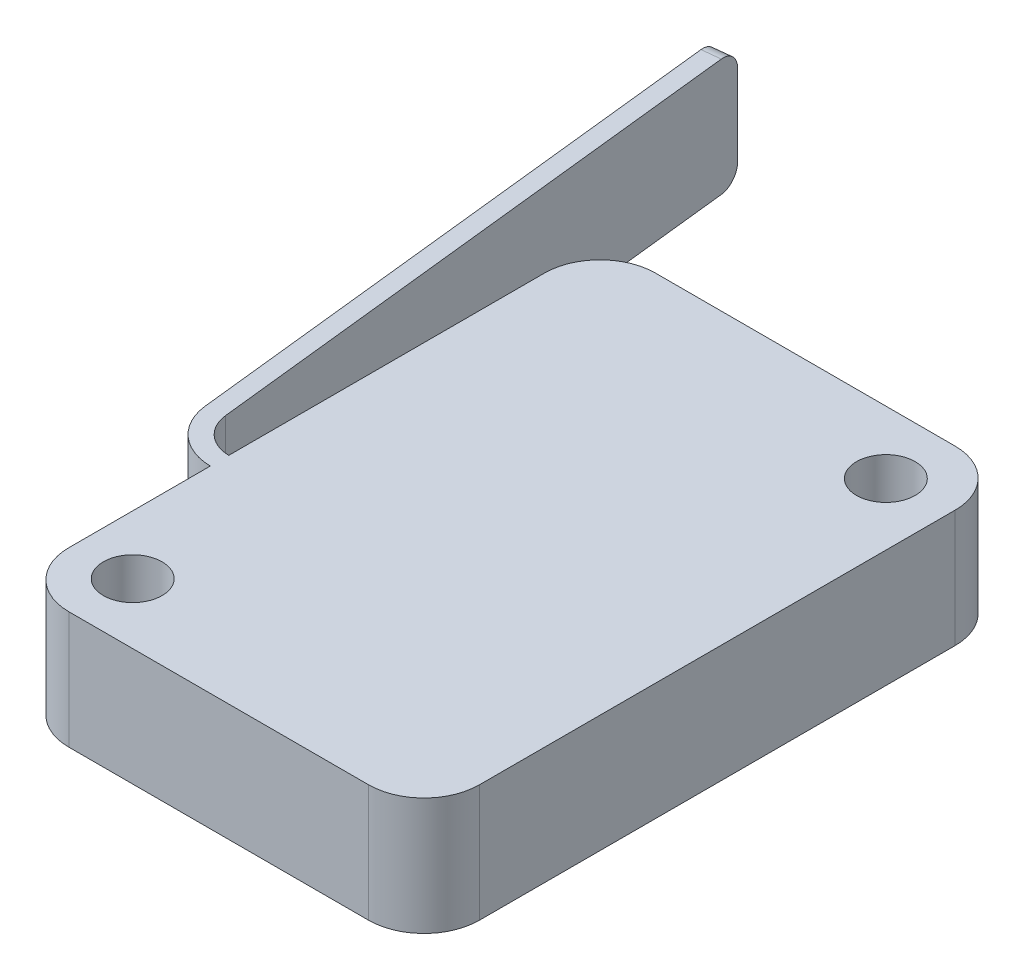
ISO-10303-21;
HEADER;
FILE_DESCRIPTION(('STEP AP214'),'2;1');
FILE_NAME('part.step','',(''),(''),'','','');
FILE_SCHEMA(('AUTOMOTIVE_DESIGN { 1 0 10303 214 1 1 1 1 }'));
ENDSEC;
DATA;
#1=APPLICATION_CONTEXT('core data for automotive mechanical design processes');
#2=APPLICATION_PROTOCOL_DEFINITION('international standard','automotive_design',2000,#1);
#3=PRODUCT_CONTEXT('',#1,'mechanical');
#4=PRODUCT('Part','Part','',(#3));
#5=PRODUCT_RELATED_PRODUCT_CATEGORY('part','',(#4));
#6=PRODUCT_DEFINITION_FORMATION('','',#4);
#7=PRODUCT_DEFINITION_CONTEXT('part definition',#1,'design');
#8=PRODUCT_DEFINITION('design','',#6,#7);
#9=PRODUCT_DEFINITION_SHAPE('','',#8);
#10=(LENGTH_UNIT() NAMED_UNIT(*) SI_UNIT(.MILLI.,.METRE.));
#11=(NAMED_UNIT(*) PLANE_ANGLE_UNIT() SI_UNIT($,.RADIAN.));
#12=(NAMED_UNIT(*) SI_UNIT($,.STERADIAN.) SOLID_ANGLE_UNIT());
#13=UNCERTAINTY_MEASURE_WITH_UNIT(LENGTH_MEASURE(1.E-05),#10,'distance_accuracy_value','');
#14=(GEOMETRIC_REPRESENTATION_CONTEXT(3) GLOBAL_UNCERTAINTY_ASSIGNED_CONTEXT((#13)) GLOBAL_UNIT_ASSIGNED_CONTEXT((#10,
#11,#12)) REPRESENTATION_CONTEXT('',''));
#15=CARTESIAN_POINT('',(0.,0.,0.));
#16=DIRECTION('',(0.,0.,1.));
#17=DIRECTION('',(1.,0.,0.));
#18=AXIS2_PLACEMENT_3D('',#15,#16,#17);
#19=CARTESIAN_POINT('',(-11.1125,6.35,15.875));
#20=DIRECTION('',(1.,0.,0.));
#21=DIRECTION('',(0.,0.,-1.));
#22=AXIS2_PLACEMENT_3D('',#19,#20,#21);
#23=PLANE('',#22);
#24=DIRECTION('',(0.,0.,1.));
#25=VECTOR('',#24,1.);
#26=CARTESIAN_POINT('',(-11.1125,0.,15.875));
#27=LINE('',#26,#25);
#28=CARTESIAN_POINT('',(-11.1125,0.,-12.875));
#29=VERTEX_POINT('',#28);
#30=CARTESIAN_POINT('',(-11.1125,0.,4.21666692304194));
#31=VERTEX_POINT('',#30);
#32=EDGE_CURVE('E221',#29,#31,#27,.T.);
#33=ORIENTED_EDGE('',*,*,#32,.T.);
#34=DIRECTION('',(0.,1.,0.));
#35=VECTOR('',#34,1.);
#36=CARTESIAN_POINT('',(-11.1125,0.,4.21666692304194));
#37=LINE('',#36,#35);
#38=CARTESIAN_POINT('',(-11.1125,6.35,4.21666692304194));
#39=VERTEX_POINT('',#38);
#40=EDGE_CURVE('E197',#31,#39,#37,.T.);
#41=ORIENTED_EDGE('',*,*,#40,.T.);
#42=DIRECTION('',(0.,0.,1.));
#43=VECTOR('',#42,1.);
#44=CARTESIAN_POINT('',(-11.1125,6.35,15.875));
#45=LINE('',#44,#43);
#46=CARTESIAN_POINT('',(-11.1125,6.35,-12.875));
#47=VERTEX_POINT('',#46);
#48=EDGE_CURVE('E209',#47,#39,#45,.T.);
#49=ORIENTED_EDGE('',*,*,#48,.F.);
#50=DIRECTION('',(0.,-1.,0.));
#51=VECTOR('',#50,1.);
#52=CARTESIAN_POINT('',(-11.1125,6.35,-12.875));
#53=LINE('',#52,#51);
#54=EDGE_CURVE('E254',#47,#29,#53,.T.);
#55=ORIENTED_EDGE('',*,*,#54,.T.);
#56=EDGE_LOOP('',(#33,#41,#49,#55));
#57=FACE_BOUND('',#56,.T.);
#58=ADVANCED_FACE('F33',(#57),#23,.F.);
#59=CARTESIAN_POINT('',(11.1125,6.35,15.875));
#60=DIRECTION('',(-1.,0.,0.));
#61=DIRECTION('',(0.,0.,1.));
#62=AXIS2_PLACEMENT_3D('',#59,#60,#61);
#63=PLANE('',#62);
#64=DIRECTION('',(0.,0.,-1.));
#65=VECTOR('',#64,1.);
#66=CARTESIAN_POINT('',(11.1125,0.,15.875));
#67=LINE('',#66,#65);
#68=CARTESIAN_POINT('',(11.1125,0.,12.875));
#69=VERTEX_POINT('',#68);
#70=CARTESIAN_POINT('',(11.1125,0.,-12.875));
#71=VERTEX_POINT('',#70);
#72=EDGE_CURVE('E200',#69,#71,#67,.T.);
#73=ORIENTED_EDGE('',*,*,#72,.T.);
#74=DIRECTION('',(0.,-1.,0.));
#75=VECTOR('',#74,1.);
#76=CARTESIAN_POINT('',(11.1125,6.35,-12.875));
#77=LINE('',#76,#75);
#78=CARTESIAN_POINT('',(11.1125,6.35,-12.875));
#79=VERTEX_POINT('',#78);
#80=EDGE_CURVE('E241',#71,#79,#77,.F.);
#81=ORIENTED_EDGE('',*,*,#80,.T.);
#82=DIRECTION('',(0.,0.,-1.));
#83=VECTOR('',#82,1.);
#84=CARTESIAN_POINT('',(11.1125,6.35,15.875));
#85=LINE('',#84,#83);
#86=CARTESIAN_POINT('',(11.1125,6.35,12.875));
#87=VERTEX_POINT('',#86);
#88=EDGE_CURVE('E201',#87,#79,#85,.T.);
#89=ORIENTED_EDGE('',*,*,#88,.F.);
#90=DIRECTION('',(0.,-1.,0.));
#91=VECTOR('',#90,1.);
#92=CARTESIAN_POINT('',(11.1125,6.35,12.875));
#93=LINE('',#92,#91);
#94=EDGE_CURVE('E238',#87,#69,#93,.T.);
#95=ORIENTED_EDGE('',*,*,#94,.T.);
#96=EDGE_LOOP('',(#73,#81,#89,#95));
#97=FACE_BOUND('',#96,.T.);
#98=ADVANCED_FACE('F326',(#97),#63,.F.);
#99=CARTESIAN_POINT('',(-11.1125,6.35,-15.875));
#100=DIRECTION('',(0.,0.,1.));
#101=DIRECTION('',(1.,0.,0.));
#102=AXIS2_PLACEMENT_3D('',#99,#100,#101);
#103=PLANE('',#102);
#104=DIRECTION('',(-1.,0.,0.));
#105=VECTOR('',#104,1.);
#106=CARTESIAN_POINT('',(-11.1125,6.35,-15.875));
#107=LINE('',#106,#105);
#108=CARTESIAN_POINT('',(8.11250000000001,6.35,-15.875));
#109=VERTEX_POINT('',#108);
#110=CARTESIAN_POINT('',(-8.11249999999999,6.35,-15.875));
#111=VERTEX_POINT('',#110);
#112=EDGE_CURVE('E204',#109,#111,#107,.T.);
#113=ORIENTED_EDGE('',*,*,#112,.F.);
#114=DIRECTION('',(0.,-1.,0.));
#115=VECTOR('',#114,1.);
#116=CARTESIAN_POINT('',(8.11250000000001,6.35,-15.875));
#117=LINE('',#116,#115);
#118=CARTESIAN_POINT('',(8.11250000000001,0.,-15.875));
#119=VERTEX_POINT('',#118);
#120=EDGE_CURVE('E227',#109,#119,#117,.T.);
#121=ORIENTED_EDGE('',*,*,#120,.T.);
#122=DIRECTION('',(-1.,0.,0.));
#123=VECTOR('',#122,1.);
#124=CARTESIAN_POINT('',(-11.1125,0.,-15.875));
#125=LINE('',#124,#123);
#126=CARTESIAN_POINT('',(-8.11249999999999,0.,-15.875));
#127=VERTEX_POINT('',#126);
#128=EDGE_CURVE('E218',#119,#127,#125,.T.);
#129=ORIENTED_EDGE('',*,*,#128,.T.);
#130=DIRECTION('',(0.,-1.,0.));
#131=VECTOR('',#130,1.);
#132=CARTESIAN_POINT('',(-8.11249999999999,6.35,-15.875));
#133=LINE('',#132,#131);
#134=EDGE_CURVE('E215',#127,#111,#133,.F.);
#135=ORIENTED_EDGE('',*,*,#134,.T.);
#136=EDGE_LOOP('',(#113,#121,#129,#135));
#137=FACE_BOUND('',#136,.T.);
#138=ADVANCED_FACE('F318',(#137),#103,.F.);
#139=CARTESIAN_POINT('',(-11.1125,6.35,5.21677658865884));
#140=VERTEX_POINT('',#139);
#141=CARTESIAN_POINT('',(-11.1125,6.35,12.875));
#142=VERTEX_POINT('',#141);
#143=EDGE_CURVE('E208',#140,#142,#45,.T.);
#144=ORIENTED_EDGE('',*,*,#143,.F.);
#145=DIRECTION('',(0.,1.,0.));
#146=VECTOR('',#145,1.);
#147=CARTESIAN_POINT('',(-11.1125,0.,5.21677658865884));
#148=LINE('',#147,#146);
#149=CARTESIAN_POINT('',(-11.1125,0.,5.21677658865884));
#150=VERTEX_POINT('',#149);
#151=EDGE_CURVE('E191',#140,#150,#148,.F.);
#152=ORIENTED_EDGE('',*,*,#151,.T.);
#153=CARTESIAN_POINT('',(-11.1125,0.,12.875));
#154=VERTEX_POINT('',#153);
#155=EDGE_CURVE('E174',#150,#154,#27,.T.);
#156=ORIENTED_EDGE('',*,*,#155,.T.);
#157=DIRECTION('',(0.,-1.,0.));
#158=VECTOR('',#157,1.);
#159=CARTESIAN_POINT('',(-11.1125,6.35,12.875));
#160=LINE('',#159,#158);
#161=EDGE_CURVE('E251',#154,#142,#160,.F.);
#162=ORIENTED_EDGE('',*,*,#161,.T.);
#163=EDGE_LOOP('',(#144,#152,#156,#162));
#164=FACE_BOUND('',#163,.T.);
#165=ADVANCED_FACE('F343',(#164),#23,.F.);
#166=CARTESIAN_POINT('',(-11.1125,6.35,15.875));
#167=DIRECTION('',(0.,0.,-1.));
#168=DIRECTION('',(-1.,0.,0.));
#169=AXIS2_PLACEMENT_3D('',#166,#167,#168);
#170=PLANE('',#169);
#171=DIRECTION('',(1.,0.,0.));
#172=VECTOR('',#171,1.);
#173=CARTESIAN_POINT('',(-11.1125,0.,15.875));
#174=LINE('',#173,#172);
#175=CARTESIAN_POINT('',(-8.11249999999999,0.,15.875));
#176=VERTEX_POINT('',#175);
#177=CARTESIAN_POINT('',(8.11250000000001,0.,15.875));
#178=VERTEX_POINT('',#177);
#179=EDGE_CURVE('E205',#176,#178,#174,.T.);
#180=ORIENTED_EDGE('',*,*,#179,.T.);
#181=DIRECTION('',(0.,-1.,0.));
#182=VECTOR('',#181,1.);
#183=CARTESIAN_POINT('',(8.11250000000001,6.35,15.875));
#184=LINE('',#183,#182);
#185=CARTESIAN_POINT('',(8.11250000000001,6.35,15.875));
#186=VERTEX_POINT('',#185);
#187=EDGE_CURVE('E260',#178,#186,#184,.F.);
#188=ORIENTED_EDGE('',*,*,#187,.T.);
#189=DIRECTION('',(1.,0.,0.));
#190=VECTOR('',#189,1.);
#191=CARTESIAN_POINT('',(-11.1125,6.35,15.875));
#192=LINE('',#191,#190);
#193=CARTESIAN_POINT('',(-8.11249999999999,6.35,15.875));
#194=VERTEX_POINT('',#193);
#195=EDGE_CURVE('E212',#194,#186,#192,.T.);
#196=ORIENTED_EDGE('',*,*,#195,.F.);
#197=DIRECTION('',(0.,-1.,0.));
#198=VECTOR('',#197,1.);
#199=CARTESIAN_POINT('',(-8.11249999999999,6.35,15.875));
#200=LINE('',#199,#198);
#201=EDGE_CURVE('E257',#194,#176,#200,.T.);
#202=ORIENTED_EDGE('',*,*,#201,.T.);
#203=EDGE_LOOP('',(#180,#188,#196,#202));
#204=FACE_BOUND('',#203,.T.);
#205=ADVANCED_FACE('F290',(#204),#170,.F.);
#206=CARTESIAN_POINT('',(0.,6.35,0.));
#207=DIRECTION('',(0.,-1.,0.));
#208=DIRECTION('',(0.,0.,-1.));
#209=AXIS2_PLACEMENT_3D('',#206,#207,#208);
#210=PLANE('',#209);
#211=CARTESIAN_POINT('',(-7.93092980778763,6.35,12.5985112128419));
#212=DIRECTION('',(0.,1.,0.));
#213=DIRECTION('',(0.,0.,1.));
#214=AXIS2_PLACEMENT_3D('',#211,#212,#213);
#215=CIRCLE('',#214,1.5875);
#216=CARTESIAN_POINT('',(-7.93092980778763,6.35,14.1860112128419));
#217=VERTEX_POINT('',#216);
#218=EDGE_CURVE('E280',#217,#217,#215,.T.);
#219=ORIENTED_EDGE('',*,*,#218,.F.);
#220=EDGE_LOOP('',(#219));
#221=FACE_BOUND('',#220,.T.);
#222=CARTESIAN_POINT('',(7.75616014482387,6.35,-12.4783549059736));
#223=DIRECTION('',(0.,1.,0.));
#224=DIRECTION('',(0.,0.,1.));
#225=AXIS2_PLACEMENT_3D('',#222,#223,#224);
#226=CIRCLE('',#225,1.5875);
#227=CARTESIAN_POINT('',(7.75616014482387,6.35,-10.8908549059736));
#228=VERTEX_POINT('',#227);
#229=EDGE_CURVE('E273',#228,#228,#226,.T.);
#230=ORIENTED_EDGE('',*,*,#229,.F.);
#231=EDGE_LOOP('',(#230));
#232=FACE_BOUND('',#231,.T.);
#233=DIRECTION('',(-0.108742622837081,0.,-0.994069938172618));
#234=VECTOR('',#233,1.);
#235=CARTESIAN_POINT('',(-16.4684300618274,6.35,-28.6837426228371));
#236=LINE('',#235,#234);
#237=CARTESIAN_POINT('',(-13.0643664848383,6.35,2.43448113550372));
#238=VERTEX_POINT('',#237);
#239=CARTESIAN_POINT('',(-16.3596874389903,6.35,-27.6896726846645));
#240=VERTEX_POINT('',#239);
#241=EDGE_CURVE('E161',#238,#240,#236,.T.);
#242=ORIENTED_EDGE('',*,*,#241,.T.);
#243=DIRECTION('',(-0.994069938172618,0.,0.108742622837082));
#244=VECTOR('',#243,1.);
#245=CARTESIAN_POINT('',(-17.3537573771629,6.35,-27.5809300618274));
#246=LINE('',#245,#244);
#247=CARTESIAN_POINT('',(-17.3537573771629,6.35,-27.5809300618274));
#248=VERTEX_POINT('',#247);
#249=EDGE_CURVE('E11',#240,#248,#246,.T.);
#250=ORIENTED_EDGE('',*,*,#249,.T.);
#251=DIRECTION('',(0.108742622837081,0.,0.994069938172618));
#252=VECTOR('',#251,1.);
#253=CARTESIAN_POINT('',(-17.4625,6.35,-28.575));
#254=LINE('',#253,#252);
#255=CARTESIAN_POINT('',(-14.058436423011,6.35,2.5432237583408));
#256=VERTEX_POINT('',#255);
#257=EDGE_CURVE('E182',#248,#256,#254,.T.);
#258=ORIENTED_EDGE('',*,*,#257,.T.);
#259=CARTESIAN_POINT('',(-11.0762266084931,6.35,2.21699588982958));
#260=DIRECTION('',(0.,1.,0.));
#261=DIRECTION('',(0.,0.,1.));
#262=AXIS2_PLACEMENT_3D('',#259,#260,#261);
#263=CIRCLE('',#262,3.);
#264=EDGE_CURVE('E167',#256,#140,#263,.T.);
#265=ORIENTED_EDGE('',*,*,#264,.T.);
#266=ORIENTED_EDGE('',*,*,#143,.T.);
#267=CARTESIAN_POINT('',(-8.11249999999999,6.35,12.875));
#268=DIRECTION('',(0.,-1.,0.));
#269=DIRECTION('',(0.,0.,-1.));
#270=AXIS2_PLACEMENT_3D('',#267,#268,#269);
#271=CIRCLE('',#270,3.);
#272=EDGE_CURVE('E243',#142,#194,#271,.F.);
#273=ORIENTED_EDGE('',*,*,#272,.T.);
#274=ORIENTED_EDGE('',*,*,#195,.T.);
#275=CARTESIAN_POINT('',(8.11250000000001,6.35,12.875));
#276=DIRECTION('',(0.,-1.,0.));
#277=DIRECTION('',(0.,0.,-1.));
#278=AXIS2_PLACEMENT_3D('',#275,#276,#277);
#279=CIRCLE('',#278,3.);
#280=EDGE_CURVE('E245',#186,#87,#279,.F.);
#281=ORIENTED_EDGE('',*,*,#280,.T.);
#282=ORIENTED_EDGE('',*,*,#88,.T.);
#283=CARTESIAN_POINT('',(8.11250000000001,6.35,-12.875));
#284=DIRECTION('',(0.,-1.,0.));
#285=DIRECTION('',(0.,0.,-1.));
#286=AXIS2_PLACEMENT_3D('',#283,#284,#285);
#287=CIRCLE('',#286,3.);
#288=EDGE_CURVE('E249',#79,#109,#287,.F.);
#289=ORIENTED_EDGE('',*,*,#288,.T.);
#290=ORIENTED_EDGE('',*,*,#112,.T.);
#291=CARTESIAN_POINT('',(-8.11249999999999,6.35,-12.875));
#292=DIRECTION('',(0.,-1.,0.));
#293=DIRECTION('',(0.,0.,-1.));
#294=AXIS2_PLACEMENT_3D('',#291,#292,#293);
#295=CIRCLE('',#294,3.);
#296=EDGE_CURVE('E247',#111,#47,#295,.F.);
#297=ORIENTED_EDGE('',*,*,#296,.T.);
#298=ORIENTED_EDGE('',*,*,#48,.T.);
#299=CARTESIAN_POINT('',(-11.0762266084931,6.35,2.21699588982958));
#300=DIRECTION('',(0.,-1.,0.));
#301=DIRECTION('',(0.,0.,1.));
#302=AXIS2_PLACEMENT_3D('',#299,#300,#301);
#303=CIRCLE('',#302,2.);
#304=EDGE_CURVE('E186',#39,#238,#303,.T.);
#305=ORIENTED_EDGE('',*,*,#304,.T.);
#306=EDGE_LOOP('',(#242,#250,#258,#265,#266,#273,#274,#281,#282,#289,#290,#297,#298,#305));
#307=FACE_BOUND('',#306,.T.);
#308=ADVANCED_FACE('F287',(#221,#232,#307),#210,.F.);
#309=CARTESIAN_POINT('',(0.,0.,0.));
#310=DIRECTION('',(0.,-1.,0.));
#311=DIRECTION('',(0.,0.,-1.));
#312=AXIS2_PLACEMENT_3D('',#309,#310,#311);
#313=PLANE('',#312);
#314=CARTESIAN_POINT('',(-7.93092980778763,0.,12.5985112128419));
#315=DIRECTION('',(0.,-1.,0.));
#316=DIRECTION('',(0.,0.,-1.));
#317=AXIS2_PLACEMENT_3D('',#314,#315,#316);
#318=CIRCLE('',#317,1.5875);
#319=CARTESIAN_POINT('',(-7.93092980778763,0.,11.0110112128419));
#320=VERTEX_POINT('',#319);
#321=EDGE_CURVE('E37',#320,#320,#318,.T.);
#322=ORIENTED_EDGE('',*,*,#321,.F.);
#323=EDGE_LOOP('',(#322));
#324=FACE_BOUND('',#323,.T.);
#325=CARTESIAN_POINT('',(7.75616014482387,0.,-12.4783549059736));
#326=DIRECTION('',(0.,-1.,0.));
#327=DIRECTION('',(0.,0.,-1.));
#328=AXIS2_PLACEMENT_3D('',#325,#326,#327);
#329=CIRCLE('',#328,1.5875);
#330=CARTESIAN_POINT('',(7.75616014482387,0.,-14.0658549059736));
#331=VERTEX_POINT('',#330);
#332=EDGE_CURVE('E184',#331,#331,#329,.T.);
#333=ORIENTED_EDGE('',*,*,#332,.F.);
#334=EDGE_LOOP('',(#333));
#335=FACE_BOUND('',#334,.T.);
#336=DIRECTION('',(0.108742622837081,0.,0.994069938172618));
#337=VECTOR('',#336,1.);
#338=CARTESIAN_POINT('',(-17.4625,0.,-28.575));
#339=LINE('',#338,#337);
#340=CARTESIAN_POINT('',(-17.3537573771629,0.,-27.5809300618274));
#341=VERTEX_POINT('',#340);
#342=CARTESIAN_POINT('',(-14.058436423011,0.,2.5432237583408));
#343=VERTEX_POINT('',#342);
#344=EDGE_CURVE('E151',#341,#343,#339,.T.);
#345=ORIENTED_EDGE('',*,*,#344,.F.);
#346=DIRECTION('',(-0.994069938172618,0.,0.108742622837082));
#347=VECTOR('',#346,1.);
#348=CARTESIAN_POINT('',(-3.1866445518112,0.,-29.1306892362066));
#349=LINE('',#348,#347);
#350=CARTESIAN_POINT('',(-16.3596874389903,0.,-27.6896726846645));
#351=VERTEX_POINT('',#350);
#352=EDGE_CURVE('E58',#341,#351,#349,.F.);
#353=ORIENTED_EDGE('',*,*,#352,.T.);
#354=DIRECTION('',(-0.108742622837081,0.,-0.994069938172618));
#355=VECTOR('',#354,1.);
#356=CARTESIAN_POINT('',(-16.4684300618274,0.,-28.6837426228371));
#357=LINE('',#356,#355);
#358=CARTESIAN_POINT('',(-13.0643664848383,0.,2.43448113550372));
#359=VERTEX_POINT('',#358);
#360=EDGE_CURVE('E177',#359,#351,#357,.T.);
#361=ORIENTED_EDGE('',*,*,#360,.F.);
#362=CARTESIAN_POINT('',(-11.0762266084931,0.,2.21699588982958));
#363=DIRECTION('',(0.,-1.,0.));
#364=DIRECTION('',(0.,0.,1.));
#365=AXIS2_PLACEMENT_3D('',#362,#363,#364);
#366=CIRCLE('',#365,2.);
#367=EDGE_CURVE('E175',#31,#359,#366,.T.);
#368=ORIENTED_EDGE('',*,*,#367,.F.);
#369=ORIENTED_EDGE('',*,*,#32,.F.);
#370=CARTESIAN_POINT('',(-8.11249999999999,0.,-12.875));
#371=DIRECTION('',(0.,-1.,0.));
#372=DIRECTION('',(0.,0.,-1.));
#373=AXIS2_PLACEMENT_3D('',#370,#371,#372);
#374=CIRCLE('',#373,3.);
#375=EDGE_CURVE('E234',#29,#127,#374,.T.);
#376=ORIENTED_EDGE('',*,*,#375,.T.);
#377=ORIENTED_EDGE('',*,*,#128,.F.);
#378=CARTESIAN_POINT('',(8.11250000000001,0.,-12.875));
#379=DIRECTION('',(0.,-1.,0.));
#380=DIRECTION('',(0.,0.,-1.));
#381=AXIS2_PLACEMENT_3D('',#378,#379,#380);
#382=CIRCLE('',#381,3.);
#383=EDGE_CURVE('E236',#119,#71,#382,.T.);
#384=ORIENTED_EDGE('',*,*,#383,.T.);
#385=ORIENTED_EDGE('',*,*,#72,.F.);
#386=CARTESIAN_POINT('',(8.11250000000001,0.,12.875));
#387=DIRECTION('',(0.,-1.,0.));
#388=DIRECTION('',(0.,0.,-1.));
#389=AXIS2_PLACEMENT_3D('',#386,#387,#388);
#390=CIRCLE('',#389,3.);
#391=EDGE_CURVE('E232',#69,#178,#390,.T.);
#392=ORIENTED_EDGE('',*,*,#391,.T.);
#393=ORIENTED_EDGE('',*,*,#179,.F.);
#394=CARTESIAN_POINT('',(-8.11249999999999,0.,12.875));
#395=DIRECTION('',(0.,-1.,0.));
#396=DIRECTION('',(0.,0.,-1.));
#397=AXIS2_PLACEMENT_3D('',#394,#395,#396);
#398=CIRCLE('',#397,3.);
#399=EDGE_CURVE('E230',#176,#154,#398,.T.);
#400=ORIENTED_EDGE('',*,*,#399,.T.);
#401=ORIENTED_EDGE('',*,*,#155,.F.);
#402=CARTESIAN_POINT('',(-11.0762266084931,0.,2.21699588982958));
#403=DIRECTION('',(0.,1.,0.));
#404=DIRECTION('',(0.,0.,1.));
#405=AXIS2_PLACEMENT_3D('',#402,#403,#404);
#406=CIRCLE('',#405,3.);
#407=EDGE_CURVE('E160',#343,#150,#406,.T.);
#408=ORIENTED_EDGE('',*,*,#407,.F.);
#409=EDGE_LOOP('',(#345,#353,#361,#368,#369,#376,#377,#384,#385,#392,#393,#400,#401,#408));
#410=FACE_BOUND('',#409,.T.);
#411=ADVANCED_FACE('F172',(#324,#335,#410),#313,.T.);
#412=CARTESIAN_POINT('',(8.11250000000001,6.35,-12.875));
#413=DIRECTION('',(0.,-1.,0.));
#414=DIRECTION('',(0.,0.,-1.));
#415=AXIS2_PLACEMENT_3D('',#412,#413,#414);
#416=CYLINDRICAL_SURFACE('',#415,3.);
#417=ORIENTED_EDGE('',*,*,#288,.F.);
#418=ORIENTED_EDGE('',*,*,#80,.F.);
#419=ORIENTED_EDGE('',*,*,#383,.F.);
#420=ORIENTED_EDGE('',*,*,#120,.F.);
#421=EDGE_LOOP('',(#417,#418,#419,#420));
#422=FACE_BOUND('',#421,.T.);
#423=ADVANCED_FACE('F322',(#422),#416,.T.);
#424=CARTESIAN_POINT('',(-8.11249999999999,6.35,-12.875));
#425=DIRECTION('',(0.,-1.,0.));
#426=DIRECTION('',(0.,0.,-1.));
#427=AXIS2_PLACEMENT_3D('',#424,#425,#426);
#428=CYLINDRICAL_SURFACE('',#427,3.);
#429=ORIENTED_EDGE('',*,*,#296,.F.);
#430=ORIENTED_EDGE('',*,*,#134,.F.);
#431=ORIENTED_EDGE('',*,*,#375,.F.);
#432=ORIENTED_EDGE('',*,*,#54,.F.);
#433=EDGE_LOOP('',(#429,#430,#431,#432));
#434=FACE_BOUND('',#433,.T.);
#435=ADVANCED_FACE('F313',(#434),#428,.T.);
#436=CARTESIAN_POINT('',(8.11250000000001,6.35,12.875));
#437=DIRECTION('',(0.,-1.,0.));
#438=DIRECTION('',(0.,0.,-1.));
#439=AXIS2_PLACEMENT_3D('',#436,#437,#438);
#440=CYLINDRICAL_SURFACE('',#439,3.);
#441=ORIENTED_EDGE('',*,*,#280,.F.);
#442=ORIENTED_EDGE('',*,*,#187,.F.);
#443=ORIENTED_EDGE('',*,*,#391,.F.);
#444=ORIENTED_EDGE('',*,*,#94,.F.);
#445=EDGE_LOOP('',(#441,#442,#443,#444));
#446=FACE_BOUND('',#445,.T.);
#447=ADVANCED_FACE('F331',(#446),#440,.T.);
#448=CARTESIAN_POINT('',(-8.11249999999999,6.35,12.875));
#449=DIRECTION('',(0.,-1.,0.));
#450=DIRECTION('',(0.,0.,-1.));
#451=AXIS2_PLACEMENT_3D('',#448,#449,#450);
#452=CYLINDRICAL_SURFACE('',#451,3.);
#453=ORIENTED_EDGE('',*,*,#272,.F.);
#454=ORIENTED_EDGE('',*,*,#161,.F.);
#455=ORIENTED_EDGE('',*,*,#399,.F.);
#456=ORIENTED_EDGE('',*,*,#201,.F.);
#457=EDGE_LOOP('',(#453,#454,#455,#456));
#458=FACE_BOUND('',#457,.T.);
#459=ADVANCED_FACE('F339',(#458),#452,.T.);
#460=CARTESIAN_POINT('',(-11.0762266084931,0.,2.21699588982958));
#461=DIRECTION('',(0.,1.,0.));
#462=DIRECTION('',(0.,0.,1.));
#463=AXIS2_PLACEMENT_3D('',#460,#461,#462);
#464=CYLINDRICAL_SURFACE('',#463,2.);
#465=ORIENTED_EDGE('',*,*,#40,.F.);
#466=ORIENTED_EDGE('',*,*,#367,.T.);
#467=DIRECTION('',(0.,1.,0.));
#468=VECTOR('',#467,1.);
#469=CARTESIAN_POINT('',(-13.0643664848383,0.,2.43448113550372));
#470=LINE('',#469,#468);
#471=EDGE_CURVE('E168',#359,#238,#470,.T.);
#472=ORIENTED_EDGE('',*,*,#471,.T.);
#473=ORIENTED_EDGE('',*,*,#304,.F.);
#474=EDGE_LOOP('',(#465,#466,#472,#473));
#475=FACE_BOUND('',#474,.T.);
#476=ADVANCED_FACE('F369',(#475),#464,.F.);
#477=CARTESIAN_POINT('',(-11.0762266084931,0.,2.21699588982958));
#478=DIRECTION('',(0.,1.,0.));
#479=DIRECTION('',(0.,0.,1.));
#480=AXIS2_PLACEMENT_3D('',#477,#478,#479);
#481=CYLINDRICAL_SURFACE('',#480,3.);
#482=ORIENTED_EDGE('',*,*,#151,.F.);
#483=ORIENTED_EDGE('',*,*,#264,.F.);
#484=DIRECTION('',(0.,1.,0.));
#485=VECTOR('',#484,1.);
#486=CARTESIAN_POINT('',(-14.058436423011,0.,2.5432237583408));
#487=LINE('',#486,#485);
#488=EDGE_CURVE('E156',#343,#256,#487,.T.);
#489=ORIENTED_EDGE('',*,*,#488,.F.);
#490=ORIENTED_EDGE('',*,*,#407,.T.);
#491=EDGE_LOOP('',(#482,#483,#489,#490));
#492=FACE_BOUND('',#491,.T.);
#493=ADVANCED_FACE('F165',(#492),#481,.T.);
#494=CARTESIAN_POINT('',(-17.4625,0.,-28.575));
#495=DIRECTION('',(-0.108742622837082,0.,-0.994069938172618));
#496=DIRECTION('',(-0.994069938172618,0.,0.108742622837082));
#497=AXIS2_PLACEMENT_3D('',#494,#495,#496);
#498=PLANE('',#497);
#499=DIRECTION('',(0.,1.,0.));
#500=VECTOR('',#499,1.);
#501=CARTESIAN_POINT('',(-16.4684300618274,0.,-28.6837426228371));
#502=LINE('',#501,#500);
#503=CARTESIAN_POINT('',(-16.4684300618274,1.,-28.6837426228371));
#504=VERTEX_POINT('',#503);
#505=CARTESIAN_POINT('',(-16.4684300618274,5.35,-28.6837426228371));
#506=VERTEX_POINT('',#505);
#507=EDGE_CURVE('E189',#504,#506,#502,.T.);
#508=ORIENTED_EDGE('',*,*,#507,.F.);
#509=DIRECTION('',(-0.994069938172618,0.,0.108742622837082));
#510=VECTOR('',#509,1.);
#511=CARTESIAN_POINT('',(-17.4625,1.,-28.575));
#512=LINE('',#511,#510);
#513=CARTESIAN_POINT('',(-17.4625,1.,-28.575));
#514=VERTEX_POINT('',#513);
#515=EDGE_CURVE('E264',#504,#514,#512,.T.);
#516=ORIENTED_EDGE('',*,*,#515,.T.);
#517=DIRECTION('',(0.,1.,0.));
#518=VECTOR('',#517,1.);
#519=CARTESIAN_POINT('',(-17.4625,0.,-28.575));
#520=LINE('',#519,#518);
#521=CARTESIAN_POINT('',(-17.4625,5.35,-28.575));
#522=VERTEX_POINT('',#521);
#523=EDGE_CURVE('E169',#514,#522,#520,.T.);
#524=ORIENTED_EDGE('',*,*,#523,.T.);
#525=DIRECTION('',(-0.994069938172618,0.,0.108742622837082));
#526=VECTOR('',#525,1.);
#527=CARTESIAN_POINT('',(-16.4684300618274,5.35,-28.6837426228371));
#528=LINE('',#527,#526);
#529=EDGE_CURVE('E262',#522,#506,#528,.F.);
#530=ORIENTED_EDGE('',*,*,#529,.T.);
#531=EDGE_LOOP('',(#508,#516,#524,#530));
#532=FACE_BOUND('',#531,.T.);
#533=ADVANCED_FACE('F299',(#532),#498,.T.);
#534=CARTESIAN_POINT('',(-16.4684300618274,0.,-28.6837426228371));
#535=DIRECTION('',(0.994069938172618,0.,-0.108742622837081));
#536=DIRECTION('',(-0.108742622837081,0.,-0.994069938172618));
#537=AXIS2_PLACEMENT_3D('',#534,#535,#536);
#538=PLANE('',#537);
#539=ORIENTED_EDGE('',*,*,#360,.T.);
#540=CARTESIAN_POINT('',(-16.3596874389903,1.,-27.6896726846645));
#541=DIRECTION('',(0.994069938172618,0.,-0.108742622837081));
#542=DIRECTION('',(-0.108742622837081,0.,-0.994069938172618));
#543=AXIS2_PLACEMENT_3D('',#540,#541,#542);
#544=CIRCLE('',#543,1.);
#545=EDGE_CURVE('E42',#351,#504,#544,.T.);
#546=ORIENTED_EDGE('',*,*,#545,.T.);
#547=ORIENTED_EDGE('',*,*,#507,.T.);
#548=CARTESIAN_POINT('',(-16.3596874389903,5.35,-27.6896726846645));
#549=DIRECTION('',(0.994069938172618,0.,-0.108742622837081));
#550=DIRECTION('',(-0.108742622837081,0.,-0.994069938172618));
#551=AXIS2_PLACEMENT_3D('',#548,#549,#550);
#552=CIRCLE('',#551,1.);
#553=EDGE_CURVE('E50',#506,#240,#552,.T.);
#554=ORIENTED_EDGE('',*,*,#553,.T.);
#555=ORIENTED_EDGE('',*,*,#241,.F.);
#556=ORIENTED_EDGE('',*,*,#471,.F.);
#557=EDGE_LOOP('',(#539,#546,#547,#554,#555,#556));
#558=FACE_BOUND('',#557,.T.);
#559=ADVANCED_FACE('F304',(#558),#538,.T.);
#560=CARTESIAN_POINT('',(-17.4625,0.,-28.575));
#561=DIRECTION('',(-0.994069938172618,0.,0.108742622837081));
#562=DIRECTION('',(0.108742622837081,0.,0.994069938172618));
#563=AXIS2_PLACEMENT_3D('',#560,#561,#562);
#564=PLANE('',#563);
#565=ORIENTED_EDGE('',*,*,#523,.F.);
#566=CARTESIAN_POINT('',(-17.3537573771629,1.,-27.5809300618274));
#567=DIRECTION('',(-0.994069938172618,0.,0.108742622837081));
#568=DIRECTION('',(0.108742622837081,0.,0.994069938172618));
#569=AXIS2_PLACEMENT_3D('',#566,#567,#568);
#570=CIRCLE('',#569,1.);
#571=EDGE_CURVE('E158',#514,#341,#570,.T.);
#572=ORIENTED_EDGE('',*,*,#571,.T.);
#573=ORIENTED_EDGE('',*,*,#344,.T.);
#574=ORIENTED_EDGE('',*,*,#488,.T.);
#575=ORIENTED_EDGE('',*,*,#257,.F.);
#576=CARTESIAN_POINT('',(-17.3537573771629,5.35,-27.5809300618274));
#577=DIRECTION('',(-0.994069938172618,0.,0.108742622837081));
#578=DIRECTION('',(0.108742622837081,0.,0.994069938172618));
#579=AXIS2_PLACEMENT_3D('',#576,#577,#578);
#580=CIRCLE('',#579,1.);
#581=EDGE_CURVE('E267',#248,#522,#580,.T.);
#582=ORIENTED_EDGE('',*,*,#581,.T.);
#583=EDGE_LOOP('',(#565,#572,#573,#574,#575,#582));
#584=FACE_BOUND('',#583,.T.);
#585=ADVANCED_FACE('F154',(#584),#564,.T.);
#586=CARTESIAN_POINT('',(-17.3537573771629,1.,-27.5809300618274));
#587=DIRECTION('',(-0.994069938172618,0.,0.108742622837082));
#588=DIRECTION('',(0.108742622837082,0.,0.994069938172618));
#589=AXIS2_PLACEMENT_3D('',#586,#587,#588);
#590=CYLINDRICAL_SURFACE('',#589,1.);
#591=ORIENTED_EDGE('',*,*,#545,.F.);
#592=ORIENTED_EDGE('',*,*,#352,.F.);
#593=ORIENTED_EDGE('',*,*,#571,.F.);
#594=ORIENTED_EDGE('',*,*,#515,.F.);
#595=EDGE_LOOP('',(#591,#592,#593,#594));
#596=FACE_BOUND('',#595,.T.);
#597=ADVANCED_FACE('F303',(#596),#590,.T.);
#598=CARTESIAN_POINT('',(-3.1866445518112,5.35,-29.1306892362066));
#599=DIRECTION('',(0.994069938172618,0.,-0.108742622837082));
#600=DIRECTION('',(-0.108742622837082,0.,-0.994069938172618));
#601=AXIS2_PLACEMENT_3D('',#598,#599,#600);
#602=CYLINDRICAL_SURFACE('',#601,1.);
#603=ORIENTED_EDGE('',*,*,#553,.F.);
#604=ORIENTED_EDGE('',*,*,#529,.F.);
#605=ORIENTED_EDGE('',*,*,#581,.F.);
#606=ORIENTED_EDGE('',*,*,#249,.F.);
#607=EDGE_LOOP('',(#603,#604,#605,#606));
#608=FACE_BOUND('',#607,.T.);
#609=ADVANCED_FACE('F35',(#608),#602,.T.);
#610=CARTESIAN_POINT('',(7.75616014482387,-10.,-12.4783549059736));
#611=DIRECTION('',(0.,1.,0.));
#612=DIRECTION('',(0.,0.,1.));
#613=AXIS2_PLACEMENT_3D('',#610,#611,#612);
#614=CYLINDRICAL_SURFACE('',#613,1.5875);
#615=ORIENTED_EDGE('',*,*,#332,.T.);
#616=EDGE_LOOP('',(#615));
#617=FACE_BOUND('',#616,.T.);
#618=ORIENTED_EDGE('',*,*,#229,.T.);
#619=EDGE_LOOP('',(#618));
#620=FACE_BOUND('',#619,.T.);
#621=ADVANCED_FACE('F375',(#617,#620),#614,.F.);
#622=CARTESIAN_POINT('',(-7.93092980778763,-10.,12.5985112128419));
#623=DIRECTION('',(0.,1.,0.));
#624=DIRECTION('',(0.,0.,1.));
#625=AXIS2_PLACEMENT_3D('',#622,#623,#624);
#626=CYLINDRICAL_SURFACE('',#625,1.5875);
#627=ORIENTED_EDGE('',*,*,#321,.T.);
#628=EDGE_LOOP('',(#627));
#629=FACE_BOUND('',#628,.T.);
#630=ORIENTED_EDGE('',*,*,#218,.T.);
#631=EDGE_LOOP('',(#630));
#632=FACE_BOUND('',#631,.T.);
#633=ADVANCED_FACE('F285',(#629,#632),#626,.F.);
#634=CLOSED_SHELL('',(#58,#98,#138,#165,#205,#308,#411,#423,#435,#447,#459,#476,#493,#533,#559,
#585,#597,#609,#621,#633));
#635=MANIFOLD_SOLID_BREP('B2',#634);
#636=ADVANCED_BREP_SHAPE_REPRESENTATION('',(#18,#635),#14);
#637=SHAPE_DEFINITION_REPRESENTATION(#9,#636);
ENDSEC;
END-ISO-10303-21;
